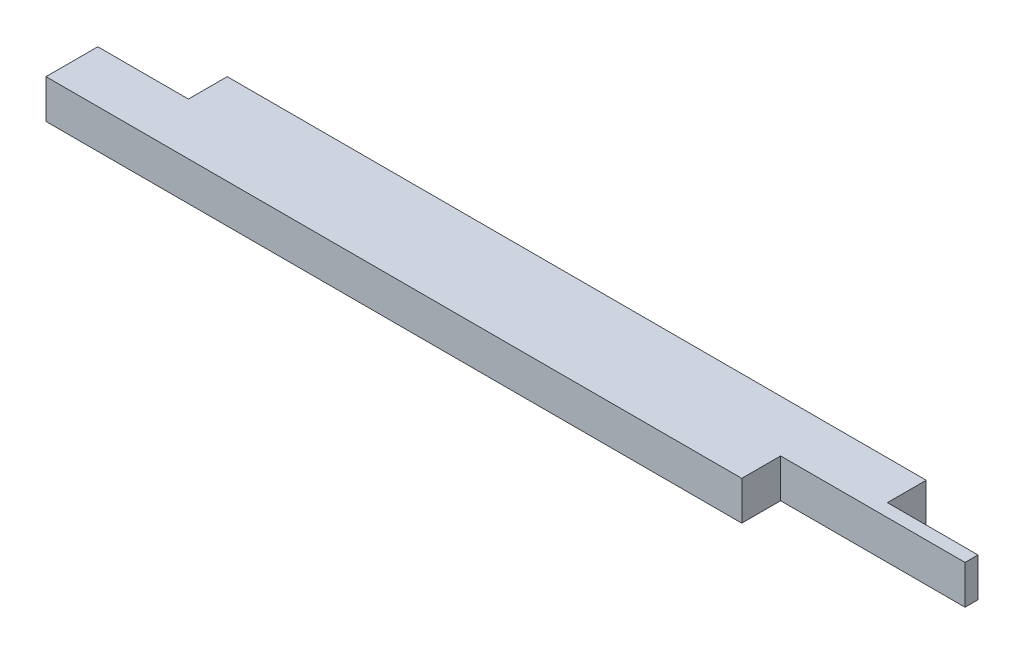
ISO-10303-21;
HEADER;
FILE_DESCRIPTION(('STEP AP214'),'2;1');
FILE_NAME('part.step','',(''),(''),'','','');
FILE_SCHEMA(('AUTOMOTIVE_DESIGN { 1 0 10303 214 1 1 1 1 }'));
ENDSEC;
DATA;
#1=APPLICATION_CONTEXT('core data for automotive mechanical design processes');
#2=APPLICATION_PROTOCOL_DEFINITION('international standard','automotive_design',2000,#1);
#3=PRODUCT_CONTEXT('',#1,'mechanical');
#4=PRODUCT('Part','Part','',(#3));
#5=PRODUCT_RELATED_PRODUCT_CATEGORY('part','',(#4));
#6=PRODUCT_DEFINITION_FORMATION('','',#4);
#7=PRODUCT_DEFINITION_CONTEXT('part definition',#1,'design');
#8=PRODUCT_DEFINITION('design','',#6,#7);
#9=PRODUCT_DEFINITION_SHAPE('','',#8);
#10=(LENGTH_UNIT() NAMED_UNIT(*) SI_UNIT(.MILLI.,.METRE.));
#11=(NAMED_UNIT(*) PLANE_ANGLE_UNIT() SI_UNIT($,.RADIAN.));
#12=(NAMED_UNIT(*) SI_UNIT($,.STERADIAN.) SOLID_ANGLE_UNIT());
#13=UNCERTAINTY_MEASURE_WITH_UNIT(LENGTH_MEASURE(1.E-05),#10,'distance_accuracy_value','');
#14=(GEOMETRIC_REPRESENTATION_CONTEXT(3) GLOBAL_UNCERTAINTY_ASSIGNED_CONTEXT((#13)) GLOBAL_UNIT_ASSIGNED_CONTEXT((#10,
#11,#12)) REPRESENTATION_CONTEXT('',''));
#15=CARTESIAN_POINT('',(0.,0.,0.));
#16=DIRECTION('',(0.,0.,1.));
#17=DIRECTION('',(1.,0.,0.));
#18=AXIS2_PLACEMENT_3D('',#15,#16,#17);
#19=CARTESIAN_POINT('',(0.,38.1,0.));
#20=DIRECTION('',(1.,0.,0.));
#21=DIRECTION('',(0.,0.,-1.));
#22=AXIS2_PLACEMENT_3D('',#19,#20,#21);
#23=PLANE('',#22);
#24=DIRECTION('',(0.,0.,1.));
#25=VECTOR('',#24,1.);
#26=CARTESIAN_POINT('',(0.,38.1,0.));
#27=LINE('',#26,#25);
#28=CARTESIAN_POINT('',(0.,38.1,-50.8));
#29=VERTEX_POINT('',#28);
#30=CARTESIAN_POINT('',(0.,38.1,0.));
#31=VERTEX_POINT('',#30);
#32=EDGE_CURVE('E151',#29,#31,#27,.T.);
#33=ORIENTED_EDGE('',*,*,#32,.F.);
#34=DIRECTION('',(0.,1.,0.));
#35=VECTOR('',#34,1.);
#36=CARTESIAN_POINT('',(0.,0.,-50.8));
#37=LINE('',#36,#35);
#38=CARTESIAN_POINT('',(0.,0.,-50.8));
#39=VERTEX_POINT('',#38);
#40=EDGE_CURVE('E194',#39,#29,#37,.T.);
#41=ORIENTED_EDGE('',*,*,#40,.F.);
#42=DIRECTION('',(0.,0.,1.));
#43=VECTOR('',#42,1.);
#44=CARTESIAN_POINT('',(0.,0.,0.));
#45=LINE('',#44,#43);
#46=CARTESIAN_POINT('',(0.,0.,0.));
#47=VERTEX_POINT('',#46);
#48=EDGE_CURVE('E153',#39,#47,#45,.T.);
#49=ORIENTED_EDGE('',*,*,#48,.T.);
#50=DIRECTION('',(0.,-1.,0.));
#51=VECTOR('',#50,1.);
#52=CARTESIAN_POINT('',(0.,38.1,0.));
#53=LINE('',#52,#51);
#54=EDGE_CURVE('E11',#31,#47,#53,.T.);
#55=ORIENTED_EDGE('',*,*,#54,.F.);
#56=EDGE_LOOP('',(#33,#41,#49,#55));
#57=FACE_BOUND('',#56,.T.);
#58=ADVANCED_FACE('F42',(#57),#23,.F.);
#59=CARTESIAN_POINT('',(0.,38.1,0.));
#60=DIRECTION('',(0.,0.,-1.));
#61=DIRECTION('',(-1.,0.,0.));
#62=AXIS2_PLACEMENT_3D('',#59,#60,#61);
#63=PLANE('',#62);
#64=DIRECTION('',(1.,0.,0.));
#65=VECTOR('',#64,1.);
#66=CARTESIAN_POINT('',(0.,0.,0.));
#67=LINE('',#66,#65);
#68=CARTESIAN_POINT('',(682.625,0.,0.));
#69=VERTEX_POINT('',#68);
#70=EDGE_CURVE('E145',#47,#69,#67,.T.);
#71=ORIENTED_EDGE('',*,*,#70,.T.);
#72=DIRECTION('',(0.,1.,0.));
#73=VECTOR('',#72,1.);
#74=CARTESIAN_POINT('',(682.625,0.,0.));
#75=LINE('',#74,#73);
#76=CARTESIAN_POINT('',(682.625,38.1,0.));
#77=VERTEX_POINT('',#76);
#78=EDGE_CURVE('E189',#69,#77,#75,.T.);
#79=ORIENTED_EDGE('',*,*,#78,.T.);
#80=DIRECTION('',(1.,0.,0.));
#81=VECTOR('',#80,1.);
#82=CARTESIAN_POINT('',(0.,38.1,0.));
#83=LINE('',#82,#81);
#84=EDGE_CURVE('E164',#31,#77,#83,.T.);
#85=ORIENTED_EDGE('',*,*,#84,.F.);
#86=ORIENTED_EDGE('',*,*,#54,.T.);
#87=EDGE_LOOP('',(#71,#79,#85,#86));
#88=FACE_BOUND('',#87,.T.);
#89=ADVANCED_FACE('F230',(#88),#63,.F.);
#90=CARTESIAN_POINT('',(863.6,38.1,0.));
#91=DIRECTION('',(-1.,0.,0.));
#92=DIRECTION('',(0.,0.,1.));
#93=AXIS2_PLACEMENT_3D('',#90,#91,#92);
#94=PLANE('',#93);
#95=DIRECTION('',(0.,0.,-1.));
#96=VECTOR('',#95,1.);
#97=CARTESIAN_POINT('',(863.6,38.1,0.));
#98=LINE('',#97,#96);
#99=CARTESIAN_POINT('',(863.6,38.1,-38.1));
#100=VERTEX_POINT('',#99);
#101=CARTESIAN_POINT('',(863.6,38.1,-50.8));
#102=VERTEX_POINT('',#101);
#103=EDGE_CURVE('E136',#100,#102,#98,.T.);
#104=ORIENTED_EDGE('',*,*,#103,.F.);
#105=DIRECTION('',(0.,1.,0.));
#106=VECTOR('',#105,1.);
#107=CARTESIAN_POINT('',(863.6,0.,-38.1));
#108=LINE('',#107,#106);
#109=CARTESIAN_POINT('',(863.6,0.,-38.1));
#110=VERTEX_POINT('',#109);
#111=EDGE_CURVE('E122',#110,#100,#108,.T.);
#112=ORIENTED_EDGE('',*,*,#111,.F.);
#113=DIRECTION('',(0.,0.,-1.));
#114=VECTOR('',#113,1.);
#115=CARTESIAN_POINT('',(863.6,0.,0.));
#116=LINE('',#115,#114);
#117=CARTESIAN_POINT('',(863.6,0.,-50.8));
#118=VERTEX_POINT('',#117);
#119=EDGE_CURVE('E134',#110,#118,#116,.T.);
#120=ORIENTED_EDGE('',*,*,#119,.T.);
#121=DIRECTION('',(0.,1.,0.));
#122=VECTOR('',#121,1.);
#123=CARTESIAN_POINT('',(863.6,0.,-50.8));
#124=LINE('',#123,#122);
#125=EDGE_CURVE('E185',#118,#102,#124,.T.);
#126=ORIENTED_EDGE('',*,*,#125,.T.);
#127=EDGE_LOOP('',(#104,#112,#120,#126));
#128=FACE_BOUND('',#127,.T.);
#129=ADVANCED_FACE('F132',(#128),#94,.F.);
#130=CARTESIAN_POINT('',(0.,38.1,-88.9));
#131=DIRECTION('',(0.,0.,1.));
#132=DIRECTION('',(1.,0.,0.));
#133=AXIS2_PLACEMENT_3D('',#130,#131,#132);
#134=PLANE('',#133);
#135=DIRECTION('',(-1.,0.,0.));
#136=VECTOR('',#135,1.);
#137=CARTESIAN_POINT('',(0.,0.,-88.9));
#138=LINE('',#137,#136);
#139=CARTESIAN_POINT('',(774.7,0.,-88.9));
#140=VERTEX_POINT('',#139);
#141=CARTESIAN_POINT('',(88.9,0.,-88.9));
#142=VERTEX_POINT('',#141);
#143=EDGE_CURVE('E144',#140,#142,#138,.T.);
#144=ORIENTED_EDGE('',*,*,#143,.T.);
#145=DIRECTION('',(0.,1.,0.));
#146=VECTOR('',#145,1.);
#147=CARTESIAN_POINT('',(88.9,0.,-88.9));
#148=LINE('',#147,#146);
#149=CARTESIAN_POINT('',(88.9,38.1,-88.9));
#150=VERTEX_POINT('',#149);
#151=EDGE_CURVE('E158',#142,#150,#148,.T.);
#152=ORIENTED_EDGE('',*,*,#151,.T.);
#153=DIRECTION('',(-1.,0.,0.));
#154=VECTOR('',#153,1.);
#155=CARTESIAN_POINT('',(0.,38.1,-88.9));
#156=LINE('',#155,#154);
#157=CARTESIAN_POINT('',(774.7,38.1,-88.9));
#158=VERTEX_POINT('',#157);
#159=EDGE_CURVE('E50',#158,#150,#156,.T.);
#160=ORIENTED_EDGE('',*,*,#159,.F.);
#161=DIRECTION('',(0.,1.,0.));
#162=VECTOR('',#161,1.);
#163=CARTESIAN_POINT('',(774.7,0.,-88.9));
#164=LINE('',#163,#162);
#165=EDGE_CURVE('E176',#140,#158,#164,.T.);
#166=ORIENTED_EDGE('',*,*,#165,.F.);
#167=EDGE_LOOP('',(#144,#152,#160,#166));
#168=FACE_BOUND('',#167,.T.);
#169=ADVANCED_FACE('F245',(#168),#134,.F.);
#170=CARTESIAN_POINT('',(0.,38.1,0.));
#171=DIRECTION('',(0.,-1.,0.));
#172=DIRECTION('',(0.,0.,-1.));
#173=AXIS2_PLACEMENT_3D('',#170,#171,#172);
#174=PLANE('',#173);
#175=ORIENTED_EDGE('',*,*,#84,.T.);
#176=DIRECTION('',(0.,0.,1.));
#177=VECTOR('',#176,1.);
#178=CARTESIAN_POINT('',(682.625,38.1,0.));
#179=LINE('',#178,#177);
#180=CARTESIAN_POINT('',(682.625,38.1,-38.1));
#181=VERTEX_POINT('',#180);
#182=EDGE_CURVE('E128',#181,#77,#179,.T.);
#183=ORIENTED_EDGE('',*,*,#182,.F.);
#184=DIRECTION('',(-1.,0.,0.));
#185=VECTOR('',#184,1.);
#186=CARTESIAN_POINT('',(863.6,38.1,-38.1));
#187=LINE('',#186,#185);
#188=EDGE_CURVE('E222',#100,#181,#187,.T.);
#189=ORIENTED_EDGE('',*,*,#188,.F.);
#190=ORIENTED_EDGE('',*,*,#103,.T.);
#191=DIRECTION('',(1.,0.,0.));
#192=VECTOR('',#191,1.);
#193=CARTESIAN_POINT('',(863.6,38.1,-50.8));
#194=LINE('',#193,#192);
#195=CARTESIAN_POINT('',(774.7,38.1,-50.8));
#196=VERTEX_POINT('',#195);
#197=EDGE_CURVE('E173',#196,#102,#194,.T.);
#198=ORIENTED_EDGE('',*,*,#197,.F.);
#199=DIRECTION('',(0.,0.,1.));
#200=VECTOR('',#199,1.);
#201=CARTESIAN_POINT('',(774.7,38.1,-88.9));
#202=LINE('',#201,#200);
#203=EDGE_CURVE('E177',#158,#196,#202,.T.);
#204=ORIENTED_EDGE('',*,*,#203,.F.);
#205=ORIENTED_EDGE('',*,*,#159,.T.);
#206=DIRECTION('',(0.,0.,-1.));
#207=VECTOR('',#206,1.);
#208=CARTESIAN_POINT('',(88.9,38.1,-88.9));
#209=LINE('',#208,#207);
#210=CARTESIAN_POINT('',(88.9,38.1,-50.8));
#211=VERTEX_POINT('',#210);
#212=EDGE_CURVE('E203',#211,#150,#209,.T.);
#213=ORIENTED_EDGE('',*,*,#212,.F.);
#214=DIRECTION('',(1.,0.,0.));
#215=VECTOR('',#214,1.);
#216=CARTESIAN_POINT('',(0.,38.1,-50.8));
#217=LINE('',#216,#215);
#218=EDGE_CURVE('E181',#29,#211,#217,.T.);
#219=ORIENTED_EDGE('',*,*,#218,.F.);
#220=ORIENTED_EDGE('',*,*,#32,.T.);
#221=EDGE_LOOP('',(#175,#183,#189,#190,#198,#204,#205,#213,#219,#220));
#222=FACE_BOUND('',#221,.T.);
#223=ADVANCED_FACE('F248',(#222),#174,.F.);
#224=CARTESIAN_POINT('',(0.,0.,0.));
#225=DIRECTION('',(0.,-1.,0.));
#226=DIRECTION('',(0.,0.,-1.));
#227=AXIS2_PLACEMENT_3D('',#224,#225,#226);
#228=PLANE('',#227);
#229=DIRECTION('',(0.,0.,1.));
#230=VECTOR('',#229,1.);
#231=CARTESIAN_POINT('',(682.625,0.,0.));
#232=LINE('',#231,#230);
#233=CARTESIAN_POINT('',(682.625,0.,-38.1));
#234=VERTEX_POINT('',#233);
#235=EDGE_CURVE('E57',#234,#69,#232,.T.);
#236=ORIENTED_EDGE('',*,*,#235,.T.);
#237=ORIENTED_EDGE('',*,*,#70,.F.);
#238=ORIENTED_EDGE('',*,*,#48,.F.);
#239=DIRECTION('',(1.,0.,0.));
#240=VECTOR('',#239,1.);
#241=CARTESIAN_POINT('',(0.,0.,-50.8));
#242=LINE('',#241,#240);
#243=CARTESIAN_POINT('',(88.9,0.,-50.8));
#244=VERTEX_POINT('',#243);
#245=EDGE_CURVE('E206',#39,#244,#242,.T.);
#246=ORIENTED_EDGE('',*,*,#245,.T.);
#247=DIRECTION('',(0.,0.,-1.));
#248=VECTOR('',#247,1.);
#249=CARTESIAN_POINT('',(88.9,0.,-88.9));
#250=LINE('',#249,#248);
#251=EDGE_CURVE('E65',#244,#142,#250,.T.);
#252=ORIENTED_EDGE('',*,*,#251,.T.);
#253=ORIENTED_EDGE('',*,*,#143,.F.);
#254=DIRECTION('',(0.,0.,1.));
#255=VECTOR('',#254,1.);
#256=CARTESIAN_POINT('',(774.7,0.,-88.9));
#257=LINE('',#256,#255);
#258=CARTESIAN_POINT('',(774.7,0.,-50.8));
#259=VERTEX_POINT('',#258);
#260=EDGE_CURVE('E170',#140,#259,#257,.T.);
#261=ORIENTED_EDGE('',*,*,#260,.T.);
#262=DIRECTION('',(1.,0.,0.));
#263=VECTOR('',#262,1.);
#264=CARTESIAN_POINT('',(863.6,0.,-50.8));
#265=LINE('',#264,#263);
#266=EDGE_CURVE('E142',#259,#118,#265,.T.);
#267=ORIENTED_EDGE('',*,*,#266,.T.);
#268=ORIENTED_EDGE('',*,*,#119,.F.);
#269=DIRECTION('',(-1.,0.,0.));
#270=VECTOR('',#269,1.);
#271=CARTESIAN_POINT('',(863.6,0.,-38.1));
#272=LINE('',#271,#270);
#273=EDGE_CURVE('E118',#110,#234,#272,.T.);
#274=ORIENTED_EDGE('',*,*,#273,.T.);
#275=EDGE_LOOP('',(#236,#237,#238,#246,#252,#253,#261,#267,#268,#274));
#276=FACE_BOUND('',#275,.T.);
#277=ADVANCED_FACE('F140',(#276),#228,.T.);
#278=CARTESIAN_POINT('',(863.6,0.,-50.8));
#279=DIRECTION('',(0.,0.,1.));
#280=DIRECTION('',(1.,0.,0.));
#281=AXIS2_PLACEMENT_3D('',#278,#279,#280);
#282=PLANE('',#281);
#283=ORIENTED_EDGE('',*,*,#197,.T.);
#284=ORIENTED_EDGE('',*,*,#125,.F.);
#285=ORIENTED_EDGE('',*,*,#266,.F.);
#286=DIRECTION('',(0.,1.,0.));
#287=VECTOR('',#286,1.);
#288=CARTESIAN_POINT('',(774.7,0.,-50.8));
#289=LINE('',#288,#287);
#290=EDGE_CURVE('E188',#259,#196,#289,.T.);
#291=ORIENTED_EDGE('',*,*,#290,.T.);
#292=EDGE_LOOP('',(#283,#284,#285,#291));
#293=FACE_BOUND('',#292,.T.);
#294=ADVANCED_FACE('F254',(#293),#282,.F.);
#295=CARTESIAN_POINT('',(774.7,0.,-88.9));
#296=DIRECTION('',(-1.,0.,0.));
#297=DIRECTION('',(0.,0.,1.));
#298=AXIS2_PLACEMENT_3D('',#295,#296,#297);
#299=PLANE('',#298);
#300=ORIENTED_EDGE('',*,*,#203,.T.);
#301=ORIENTED_EDGE('',*,*,#290,.F.);
#302=ORIENTED_EDGE('',*,*,#260,.F.);
#303=ORIENTED_EDGE('',*,*,#165,.T.);
#304=EDGE_LOOP('',(#300,#301,#302,#303));
#305=FACE_BOUND('',#304,.T.);
#306=ADVANCED_FACE('F252',(#305),#299,.F.);
#307=CARTESIAN_POINT('',(88.9,0.,-88.9));
#308=DIRECTION('',(1.,0.,0.));
#309=DIRECTION('',(0.,0.,-1.));
#310=AXIS2_PLACEMENT_3D('',#307,#308,#309);
#311=PLANE('',#310);
#312=ORIENTED_EDGE('',*,*,#212,.T.);
#313=ORIENTED_EDGE('',*,*,#151,.F.);
#314=ORIENTED_EDGE('',*,*,#251,.F.);
#315=DIRECTION('',(0.,1.,0.));
#316=VECTOR('',#315,1.);
#317=CARTESIAN_POINT('',(88.9,0.,-50.8));
#318=LINE('',#317,#316);
#319=EDGE_CURVE('E197',#244,#211,#318,.T.);
#320=ORIENTED_EDGE('',*,*,#319,.T.);
#321=EDGE_LOOP('',(#312,#313,#314,#320));
#322=FACE_BOUND('',#321,.T.);
#323=ADVANCED_FACE('F241',(#322),#311,.F.);
#324=CARTESIAN_POINT('',(0.,0.,-50.8));
#325=DIRECTION('',(0.,0.,1.));
#326=DIRECTION('',(1.,0.,0.));
#327=AXIS2_PLACEMENT_3D('',#324,#325,#326);
#328=PLANE('',#327);
#329=ORIENTED_EDGE('',*,*,#218,.T.);
#330=ORIENTED_EDGE('',*,*,#319,.F.);
#331=ORIENTED_EDGE('',*,*,#245,.F.);
#332=ORIENTED_EDGE('',*,*,#40,.T.);
#333=EDGE_LOOP('',(#329,#330,#331,#332));
#334=FACE_BOUND('',#333,.T.);
#335=ADVANCED_FACE('F238',(#334),#328,.F.);
#336=CARTESIAN_POINT('',(682.625,0.,0.));
#337=DIRECTION('',(-1.,0.,0.));
#338=DIRECTION('',(0.,0.,1.));
#339=AXIS2_PLACEMENT_3D('',#336,#337,#338);
#340=PLANE('',#339);
#341=ORIENTED_EDGE('',*,*,#182,.T.);
#342=ORIENTED_EDGE('',*,*,#78,.F.);
#343=ORIENTED_EDGE('',*,*,#235,.F.);
#344=DIRECTION('',(0.,1.,0.));
#345=VECTOR('',#344,1.);
#346=CARTESIAN_POINT('',(682.625,0.,-38.1));
#347=LINE('',#346,#345);
#348=EDGE_CURVE('E124',#234,#181,#347,.T.);
#349=ORIENTED_EDGE('',*,*,#348,.T.);
#350=EDGE_LOOP('',(#341,#342,#343,#349));
#351=FACE_BOUND('',#350,.T.);
#352=ADVANCED_FACE('F290',(#351),#340,.F.);
#353=CARTESIAN_POINT('',(863.6,0.,-38.1));
#354=DIRECTION('',(0.,0.,-1.));
#355=DIRECTION('',(-1.,0.,0.));
#356=AXIS2_PLACEMENT_3D('',#353,#354,#355);
#357=PLANE('',#356);
#358=ORIENTED_EDGE('',*,*,#188,.T.);
#359=ORIENTED_EDGE('',*,*,#348,.F.);
#360=ORIENTED_EDGE('',*,*,#273,.F.);
#361=ORIENTED_EDGE('',*,*,#111,.T.);
#362=EDGE_LOOP('',(#358,#359,#360,#361));
#363=FACE_BOUND('',#362,.T.);
#364=ADVANCED_FACE('F121',(#363),#357,.F.);
#365=CLOSED_SHELL('',(#58,#89,#129,#169,#223,#277,#294,#306,#323,#335,#352,#364));
#366=MANIFOLD_SOLID_BREP('B2',#365);
#367=ADVANCED_BREP_SHAPE_REPRESENTATION('',(#18,#366),#14);
#368=SHAPE_DEFINITION_REPRESENTATION(#9,#367);
ENDSEC;
END-ISO-10303-21;
